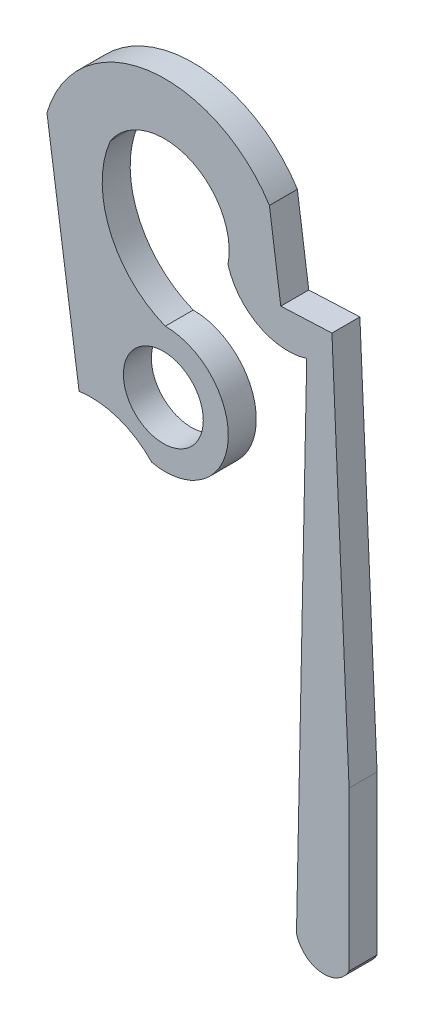
ISO-10303-21;
HEADER;
FILE_DESCRIPTION(('STEP AP214'),'2;1');
FILE_NAME('part.step','',(''),(''),'','','');
FILE_SCHEMA(('AUTOMOTIVE_DESIGN { 1 0 10303 214 1 1 1 1 }'));
ENDSEC;
DATA;
#1=APPLICATION_CONTEXT('core data for automotive mechanical design processes');
#2=APPLICATION_PROTOCOL_DEFINITION('international standard','automotive_design',2000,#1);
#3=PRODUCT_CONTEXT('',#1,'mechanical');
#4=PRODUCT('Part','Part','',(#3));
#5=PRODUCT_RELATED_PRODUCT_CATEGORY('part','',(#4));
#6=PRODUCT_DEFINITION_FORMATION('','',#4);
#7=PRODUCT_DEFINITION_CONTEXT('part definition',#1,'design');
#8=PRODUCT_DEFINITION('design','',#6,#7);
#9=PRODUCT_DEFINITION_SHAPE('','',#8);
#10=(LENGTH_UNIT() NAMED_UNIT(*) SI_UNIT(.MILLI.,.METRE.));
#11=(NAMED_UNIT(*) PLANE_ANGLE_UNIT() SI_UNIT($,.RADIAN.));
#12=(NAMED_UNIT(*) SI_UNIT($,.STERADIAN.) SOLID_ANGLE_UNIT());
#13=UNCERTAINTY_MEASURE_WITH_UNIT(LENGTH_MEASURE(1.E-05),#10,'distance_accuracy_value','');
#14=(GEOMETRIC_REPRESENTATION_CONTEXT(3) GLOBAL_UNCERTAINTY_ASSIGNED_CONTEXT((#13)) GLOBAL_UNIT_ASSIGNED_CONTEXT((#10,
#11,#12)) REPRESENTATION_CONTEXT('',''));
#15=CARTESIAN_POINT('',(0.,0.,0.));
#16=DIRECTION('',(0.,0.,1.));
#17=DIRECTION('',(1.,0.,0.));
#18=AXIS2_PLACEMENT_3D('',#15,#16,#17);
#19=CARTESIAN_POINT('',(-0.764555015026057,6.89651456807278,0.889));
#20=DIRECTION('',(0.,0.,1.));
#21=DIRECTION('',(1.,0.,0.));
#22=AXIS2_PLACEMENT_3D('',#19,#20,#21);
#23=PLANE('',#22);
#24=CARTESIAN_POINT('',(-0.764555015026057,6.89651456807278,0.889));
#25=DIRECTION('',(0.,0.,1.));
#26=DIRECTION('',(1.,0.,0.));
#27=AXIS2_PLACEMENT_3D('',#24,#25,#26);
#28=CIRCLE('',#27,3.91525112739899);
#29=CARTESIAN_POINT('',(2.54878635499703,8.98241014462799,0.889));
#30=VERTEX_POINT('',#29);
#31=CARTESIAN_POINT('',(-4.52195711683766,7.99702392100933,0.889));
#32=VERTEX_POINT('',#31);
#33=EDGE_CURVE('E218',#30,#32,#28,.T.);
#34=ORIENTED_EDGE('',*,*,#33,.T.);
#35=DIRECTION('',(0.141342617422506,-0.98996073886804,0.));
#36=VECTOR('',#35,1.);
#37=CARTESIAN_POINT('',(-4.52195711683766,7.99702392100933,0.889));
#38=LINE('',#37,#36);
#39=CARTESIAN_POINT('',(-3.50064084270403,0.843746078863655,0.889));
#40=VERTEX_POINT('',#39);
#41=EDGE_CURVE('E124',#32,#40,#38,.T.);
#42=ORIENTED_EDGE('',*,*,#41,.T.);
#43=CARTESIAN_POINT('',(-3.12450204033118,-1.80167889257873,0.889));
#44=DIRECTION('',(0.,0.,-1.));
#45=DIRECTION('',(-1.,0.,0.));
#46=AXIS2_PLACEMENT_3D('',#43,#44,#45);
#47=CIRCLE('',#46,2.67203175096808);
#48=CARTESIAN_POINT('',(-1.18943230542014,0.0409439117990268,0.889));
#49=VERTEX_POINT('',#48);
#50=EDGE_CURVE('E259',#40,#49,#47,.T.);
#51=ORIENTED_EDGE('',*,*,#50,.T.);
#52=CARTESIAN_POINT('',(-0.761885284854942,1.99978176323309,0.889));
#53=DIRECTION('',(0.,0.,1.));
#54=DIRECTION('',(1.,0.,0.));
#55=AXIS2_PLACEMENT_3D('',#52,#53,#54);
#56=CIRCLE('',#55,2.00495440920861);
#57=CARTESIAN_POINT('',(-0.76188528485497,4.0047361724417,0.889));
#58=VERTEX_POINT('',#57);
#59=EDGE_CURVE('E279',#49,#58,#56,.T.);
#60=ORIENTED_EDGE('',*,*,#59,.T.);
#61=CARTESIAN_POINT('',(0.431221925221187,6.97103879163964,0.889));
#62=DIRECTION('',(0.,0.,-1.));
#63=DIRECTION('',(-1.,0.,0.));
#64=AXIS2_PLACEMENT_3D('',#61,#62,#63);
#65=CIRCLE('',#64,3.19725758164653);
#66=CARTESIAN_POINT('',(-2.50756187158796,8.23040602918722,0.889));
#67=VERTEX_POINT('',#66);
#68=EDGE_CURVE('E275',#58,#67,#65,.T.);
#69=ORIENTED_EDGE('',*,*,#68,.T.);
#70=CARTESIAN_POINT('',(-0.789552238138536,7.09308352010314,0.889));
#71=DIRECTION('',(0.,0.,-1.));
#72=DIRECTION('',(-1.,0.,0.));
#73=AXIS2_PLACEMENT_3D('',#70,#71,#72);
#74=CIRCLE('',#73,2.06035423903132);
#75=CARTESIAN_POINT('',(1.2324345503255,6.69731967944675,0.889));
#76=VERTEX_POINT('',#75);
#77=EDGE_CURVE('E278',#67,#76,#74,.T.);
#78=ORIENTED_EDGE('',*,*,#77,.T.);
#79=CARTESIAN_POINT('',(3.13473023692255,7.25343080850267,0.889));
#80=DIRECTION('',(0.,0.,1.));
#81=DIRECTION('',(1.,0.,0.));
#82=AXIS2_PLACEMENT_3D('',#79,#80,#81);
#83=CIRCLE('',#82,1.98191535316357);
#84=CARTESIAN_POINT('',(3.73486881188279,5.36456285177563,0.889));
#85=VERTEX_POINT('',#84);
#86=EDGE_CURVE('E283',#76,#85,#83,.T.);
#87=ORIENTED_EDGE('',*,*,#86,.T.);
#88=DIRECTION('',(-0.0203457676218141,-0.999793003446153,0.));
#89=VECTOR('',#88,1.);
#90=CARTESIAN_POINT('',(3.73486881188279,5.36456285177564,0.889));
#91=LINE('',#90,#89);
#92=CARTESIAN_POINT('',(3.40964775399991,-10.616831622425,0.889));
#93=VERTEX_POINT('',#92);
#94=EDGE_CURVE('E290',#85,#93,#91,.T.);
#95=ORIENTED_EDGE('',*,*,#94,.T.);
#96=CARTESIAN_POINT('',(4.28443912780325,-10.4110378817667,0.889));
#97=DIRECTION('',(0.,0.,1.));
#98=DIRECTION('',(1.,0.,0.));
#99=AXIS2_PLACEMENT_3D('',#96,#97,#98);
#100=CIRCLE('',#99,0.898671804039087);
#101=CARTESIAN_POINT('',(5.08128140266139,-10.8265537062232,0.889));
#102=VERTEX_POINT('',#101);
#103=EDGE_CURVE('E293',#93,#102,#100,.T.);
#104=ORIENTED_EDGE('',*,*,#103,.T.);
#105=DIRECTION('',(0.,1.,0.));
#106=VECTOR('',#105,1.);
#107=CARTESIAN_POINT('',(5.08128140266139,-10.8265537062232,0.889));
#108=LINE('',#107,#106);
#109=CARTESIAN_POINT('',(5.08128140266142,-5.78834765871356,0.889));
#110=VERTEX_POINT('',#109);
#111=EDGE_CURVE('E158',#102,#110,#108,.T.);
#112=ORIENTED_EDGE('',*,*,#111,.T.);
#113=DIRECTION('',(-0.0444556497936911,0.999011358895093,0.));
#114=VECTOR('',#113,1.);
#115=CARTESIAN_POINT('',(4.53606219398666,6.46386741589675,0.889));
#116=LINE('',#115,#114);
#117=CARTESIAN_POINT('',(4.53606219398666,6.46386741589675,0.889));
#118=VERTEX_POINT('',#117);
#119=EDGE_CURVE('E152',#110,#118,#116,.T.);
#120=ORIENTED_EDGE('',*,*,#119,.T.);
#121=DIRECTION('',(-0.999011358895093,-0.044455649793691,0.));
#122=VECTOR('',#121,1.);
#123=CARTESIAN_POINT('',(2.91034581646799,6.39152361589957,0.889));
#124=LINE('',#123,#122);
#125=CARTESIAN_POINT('',(2.91034581646799,6.39152361589957,0.889));
#126=VERTEX_POINT('',#125);
#127=EDGE_CURVE('E156',#118,#126,#124,.T.);
#128=ORIENTED_EDGE('',*,*,#127,.T.);
#129=DIRECTION('',(-0.138211184527533,0.990402780928798,0.));
#130=VECTOR('',#129,1.);
#131=CARTESIAN_POINT('',(2.54878635499703,8.98241014462799,0.889));
#132=LINE('',#131,#130);
#133=EDGE_CURVE('E66',#126,#30,#132,.T.);
#134=ORIENTED_EDGE('',*,*,#133,.T.);
#135=EDGE_LOOP('',(#34,#42,#51,#60,#69,#78,#87,#95,#104,#112,#120,#128,#134));
#136=FACE_BOUND('',#135,.T.);
#137=CARTESIAN_POINT('',(-0.822961987657009,2.0129242920782,0.889));
#138=DIRECTION('',(0.,0.,1.));
#139=DIRECTION('',(1.,0.,0.));
#140=AXIS2_PLACEMENT_3D('',#137,#138,#139);
#141=CIRCLE('',#140,1.27);
#142=CARTESIAN_POINT('',(0.447038012342992,2.0129242920782,0.889));
#143=VERTEX_POINT('',#142);
#144=EDGE_CURVE('E185',#143,#143,#141,.T.);
#145=ORIENTED_EDGE('',*,*,#144,.F.);
#146=EDGE_LOOP('',(#145));
#147=FACE_BOUND('',#146,.T.);
#148=ADVANCED_FACE('F48',(#136,#147),#23,.T.);
#149=CARTESIAN_POINT('',(-0.764555015026057,6.89651456807278,0.));
#150=DIRECTION('',(0.,0.,1.));
#151=DIRECTION('',(1.,0.,0.));
#152=AXIS2_PLACEMENT_3D('',#149,#150,#151);
#153=PLANE('',#152);
#154=CARTESIAN_POINT('',(-0.764555015026057,6.89651456807278,0.));
#155=DIRECTION('',(0.,0.,1.));
#156=DIRECTION('',(1.,0.,0.));
#157=AXIS2_PLACEMENT_3D('',#154,#155,#156);
#158=CIRCLE('',#157,3.91525112739899);
#159=CARTESIAN_POINT('',(2.54878635499703,8.98241014462799,0.));
#160=VERTEX_POINT('',#159);
#161=CARTESIAN_POINT('',(-4.52195711683766,7.99702392100933,0.));
#162=VERTEX_POINT('',#161);
#163=EDGE_CURVE('E180',#160,#162,#158,.T.);
#164=ORIENTED_EDGE('',*,*,#163,.F.);
#165=DIRECTION('',(-0.138211184527533,0.990402780928798,0.));
#166=VECTOR('',#165,1.);
#167=CARTESIAN_POINT('',(2.54878635499703,8.98241014462799,0.));
#168=LINE('',#167,#166);
#169=CARTESIAN_POINT('',(2.91034581646799,6.39152361589957,0.));
#170=VERTEX_POINT('',#169);
#171=EDGE_CURVE('E116',#170,#160,#168,.T.);
#172=ORIENTED_EDGE('',*,*,#171,.F.);
#173=DIRECTION('',(-0.999011358895093,-0.044455649793691,0.));
#174=VECTOR('',#173,1.);
#175=CARTESIAN_POINT('',(2.91034581646799,6.39152361589957,0.));
#176=LINE('',#175,#174);
#177=CARTESIAN_POINT('',(4.53606219398666,6.46386741589675,0.));
#178=VERTEX_POINT('',#177);
#179=EDGE_CURVE('E110',#178,#170,#176,.T.);
#180=ORIENTED_EDGE('',*,*,#179,.F.);
#181=DIRECTION('',(-0.0444556497936911,0.999011358895093,0.));
#182=VECTOR('',#181,1.);
#183=CARTESIAN_POINT('',(4.53606219398666,6.46386741589675,0.));
#184=LINE('',#183,#182);
#185=CARTESIAN_POINT('',(5.08128140266142,-5.78834765871356,0.));
#186=VERTEX_POINT('',#185);
#187=EDGE_CURVE('E167',#186,#178,#184,.T.);
#188=ORIENTED_EDGE('',*,*,#187,.F.);
#189=DIRECTION('',(0.,1.,0.));
#190=VECTOR('',#189,1.);
#191=CARTESIAN_POINT('',(5.08128140266139,-10.8265537062232,0.));
#192=LINE('',#191,#190);
#193=CARTESIAN_POINT('',(5.08128140266139,-10.8265537062232,0.));
#194=VERTEX_POINT('',#193);
#195=EDGE_CURVE('E209',#194,#186,#192,.T.);
#196=ORIENTED_EDGE('',*,*,#195,.F.);
#197=CARTESIAN_POINT('',(4.28443912780325,-10.4110378817667,0.));
#198=DIRECTION('',(0.,0.,1.));
#199=DIRECTION('',(1.,0.,0.));
#200=AXIS2_PLACEMENT_3D('',#197,#198,#199);
#201=CIRCLE('',#200,0.898671804039087);
#202=CARTESIAN_POINT('',(3.40964775399991,-10.616831622425,0.));
#203=VERTEX_POINT('',#202);
#204=EDGE_CURVE('E206',#203,#194,#201,.T.);
#205=ORIENTED_EDGE('',*,*,#204,.F.);
#206=DIRECTION('',(-0.0203457676218141,-0.999793003446153,0.));
#207=VECTOR('',#206,1.);
#208=CARTESIAN_POINT('',(3.73486881188279,5.36456285177564,0.));
#209=LINE('',#208,#207);
#210=CARTESIAN_POINT('',(3.73486881188279,5.36456285177563,0.));
#211=VERTEX_POINT('',#210);
#212=EDGE_CURVE('E203',#211,#203,#209,.T.);
#213=ORIENTED_EDGE('',*,*,#212,.F.);
#214=CARTESIAN_POINT('',(3.13473023692255,7.25343080850267,0.));
#215=DIRECTION('',(0.,0.,1.));
#216=DIRECTION('',(1.,0.,0.));
#217=AXIS2_PLACEMENT_3D('',#214,#215,#216);
#218=CIRCLE('',#217,1.98191535316357);
#219=CARTESIAN_POINT('',(1.2324345503255,6.69731967944675,0.));
#220=VERTEX_POINT('',#219);
#221=EDGE_CURVE('E200',#220,#211,#218,.T.);
#222=ORIENTED_EDGE('',*,*,#221,.F.);
#223=CARTESIAN_POINT('',(-0.789552238138536,7.09308352010314,0.));
#224=DIRECTION('',(0.,0.,-1.));
#225=DIRECTION('',(-1.,0.,0.));
#226=AXIS2_PLACEMENT_3D('',#223,#224,#225);
#227=CIRCLE('',#226,2.06035423903132);
#228=CARTESIAN_POINT('',(-2.50756187158796,8.23040602918722,0.));
#229=VERTEX_POINT('',#228);
#230=EDGE_CURVE('E197',#229,#220,#227,.T.);
#231=ORIENTED_EDGE('',*,*,#230,.F.);
#232=CARTESIAN_POINT('',(0.431221925221187,6.97103879163964,0.));
#233=DIRECTION('',(0.,0.,-1.));
#234=DIRECTION('',(-1.,0.,0.));
#235=AXIS2_PLACEMENT_3D('',#232,#233,#234);
#236=CIRCLE('',#235,3.19725758164653);
#237=CARTESIAN_POINT('',(-0.76188528485497,4.0047361724417,0.));
#238=VERTEX_POINT('',#237);
#239=EDGE_CURVE('E194',#238,#229,#236,.T.);
#240=ORIENTED_EDGE('',*,*,#239,.F.);
#241=CARTESIAN_POINT('',(-0.761885284854942,1.99978176323309,0.));
#242=DIRECTION('',(0.,0.,1.));
#243=DIRECTION('',(1.,0.,0.));
#244=AXIS2_PLACEMENT_3D('',#241,#242,#243);
#245=CIRCLE('',#244,2.00495440920861);
#246=CARTESIAN_POINT('',(-1.18943230542014,0.0409439117990268,0.));
#247=VERTEX_POINT('',#246);
#248=EDGE_CURVE('E191',#247,#238,#245,.T.);
#249=ORIENTED_EDGE('',*,*,#248,.F.);
#250=CARTESIAN_POINT('',(-3.12450204033118,-1.80167889257873,0.));
#251=DIRECTION('',(0.,0.,-1.));
#252=DIRECTION('',(-1.,0.,0.));
#253=AXIS2_PLACEMENT_3D('',#250,#251,#252);
#254=CIRCLE('',#253,2.67203175096808);
#255=CARTESIAN_POINT('',(-3.50064084270403,0.843746078863655,0.));
#256=VERTEX_POINT('',#255);
#257=EDGE_CURVE('E188',#256,#247,#254,.T.);
#258=ORIENTED_EDGE('',*,*,#257,.F.);
#259=DIRECTION('',(0.141342617422506,-0.98996073886804,0.));
#260=VECTOR('',#259,1.);
#261=CARTESIAN_POINT('',(-4.52195711683766,7.99702392100933,0.));
#262=LINE('',#261,#260);
#263=EDGE_CURVE('E184',#162,#256,#262,.T.);
#264=ORIENTED_EDGE('',*,*,#263,.F.);
#265=EDGE_LOOP('',(#164,#172,#180,#188,#196,#205,#213,#222,#231,#240,#249,#258,#264));
#266=FACE_BOUND('',#265,.T.);
#267=CARTESIAN_POINT('',(-0.822961987657009,2.0129242920782,0.));
#268=DIRECTION('',(0.,0.,1.));
#269=DIRECTION('',(1.,0.,0.));
#270=AXIS2_PLACEMENT_3D('',#267,#268,#269);
#271=CIRCLE('',#270,1.27);
#272=CARTESIAN_POINT('',(0.447038012342992,2.0129242920782,0.));
#273=VERTEX_POINT('',#272);
#274=EDGE_CURVE('E423',#273,#273,#271,.T.);
#275=ORIENTED_EDGE('',*,*,#274,.T.);
#276=EDGE_LOOP('',(#275));
#277=FACE_BOUND('',#276,.T.);
#278=ADVANCED_FACE('F263',(#266,#277),#153,.F.);
#279=CARTESIAN_POINT('',(-0.764555015026057,6.89651456807278,0.889));
#280=DIRECTION('',(0.,0.,-1.));
#281=DIRECTION('',(-1.,0.,0.));
#282=AXIS2_PLACEMENT_3D('',#279,#280,#281);
#283=CYLINDRICAL_SURFACE('',#282,3.91525112739899);
#284=ORIENTED_EDGE('',*,*,#163,.T.);
#285=DIRECTION('',(0.,0.,-1.));
#286=VECTOR('',#285,1.);
#287=CARTESIAN_POINT('',(-4.52195711683766,7.99702392100933,0.889));
#288=LINE('',#287,#286);
#289=EDGE_CURVE('E13',#32,#162,#288,.T.);
#290=ORIENTED_EDGE('',*,*,#289,.F.);
#291=ORIENTED_EDGE('',*,*,#33,.F.);
#292=DIRECTION('',(0.,0.,-1.));
#293=VECTOR('',#292,1.);
#294=CARTESIAN_POINT('',(2.54878635499703,8.98241014462799,0.889));
#295=LINE('',#294,#293);
#296=EDGE_CURVE('E176',#30,#160,#295,.T.);
#297=ORIENTED_EDGE('',*,*,#296,.T.);
#298=EDGE_LOOP('',(#284,#290,#291,#297));
#299=FACE_BOUND('',#298,.T.);
#300=ADVANCED_FACE('F50',(#299),#283,.T.);
#301=CARTESIAN_POINT('',(-4.52195711683766,7.99702392100933,0.889));
#302=DIRECTION('',(0.98996073886804,0.141342617422506,0.));
#303=DIRECTION('',(-0.141342617422506,0.98996073886804,0.));
#304=AXIS2_PLACEMENT_3D('',#301,#302,#303);
#305=PLANE('',#304);
#306=ORIENTED_EDGE('',*,*,#263,.T.);
#307=DIRECTION('',(0.,0.,-1.));
#308=VECTOR('',#307,1.);
#309=CARTESIAN_POINT('',(-3.50064084270403,0.843746078863655,0.889));
#310=LINE('',#309,#308);
#311=EDGE_CURVE('E58',#40,#256,#310,.T.);
#312=ORIENTED_EDGE('',*,*,#311,.F.);
#313=ORIENTED_EDGE('',*,*,#41,.F.);
#314=ORIENTED_EDGE('',*,*,#289,.T.);
#315=EDGE_LOOP('',(#306,#312,#313,#314));
#316=FACE_BOUND('',#315,.T.);
#317=ADVANCED_FACE('F329',(#316),#305,.F.);
#318=CARTESIAN_POINT('',(-3.12450204033118,-1.80167889257873,0.889));
#319=DIRECTION('',(0.,0.,-1.));
#320=DIRECTION('',(-1.,0.,0.));
#321=AXIS2_PLACEMENT_3D('',#318,#319,#320);
#322=CYLINDRICAL_SURFACE('',#321,2.67203175096808);
#323=ORIENTED_EDGE('',*,*,#257,.T.);
#324=DIRECTION('',(0.,0.,-1.));
#325=VECTOR('',#324,1.);
#326=CARTESIAN_POINT('',(-1.18943230542014,0.0409439117990268,0.889));
#327=LINE('',#326,#325);
#328=EDGE_CURVE('E249',#49,#247,#327,.T.);
#329=ORIENTED_EDGE('',*,*,#328,.F.);
#330=ORIENTED_EDGE('',*,*,#50,.F.);
#331=ORIENTED_EDGE('',*,*,#311,.T.);
#332=EDGE_LOOP('',(#323,#329,#330,#331));
#333=FACE_BOUND('',#332,.T.);
#334=ADVANCED_FACE('F257',(#333),#322,.F.);
#335=CARTESIAN_POINT('',(-0.761885284854942,1.99978176323309,0.889));
#336=DIRECTION('',(0.,0.,-1.));
#337=DIRECTION('',(-1.,0.,0.));
#338=AXIS2_PLACEMENT_3D('',#335,#336,#337);
#339=CYLINDRICAL_SURFACE('',#338,2.00495440920861);
#340=ORIENTED_EDGE('',*,*,#248,.T.);
#341=DIRECTION('',(0.,0.,-1.));
#342=VECTOR('',#341,1.);
#343=CARTESIAN_POINT('',(-0.76188528485497,4.0047361724417,0.889));
#344=LINE('',#343,#342);
#345=EDGE_CURVE('E245',#58,#238,#344,.T.);
#346=ORIENTED_EDGE('',*,*,#345,.F.);
#347=ORIENTED_EDGE('',*,*,#59,.F.);
#348=ORIENTED_EDGE('',*,*,#328,.T.);
#349=EDGE_LOOP('',(#340,#346,#347,#348));
#350=FACE_BOUND('',#349,.T.);
#351=ADVANCED_FACE('F269',(#350),#339,.T.);
#352=CARTESIAN_POINT('',(0.431221925221187,6.97103879163964,0.889));
#353=DIRECTION('',(0.,0.,-1.));
#354=DIRECTION('',(-1.,0.,0.));
#355=AXIS2_PLACEMENT_3D('',#352,#353,#354);
#356=CYLINDRICAL_SURFACE('',#355,3.19725758164653);
#357=ORIENTED_EDGE('',*,*,#239,.T.);
#358=DIRECTION('',(0.,0.,-1.));
#359=VECTOR('',#358,1.);
#360=CARTESIAN_POINT('',(-2.50756187158796,8.23040602918722,0.889));
#361=LINE('',#360,#359);
#362=EDGE_CURVE('E241',#67,#229,#361,.T.);
#363=ORIENTED_EDGE('',*,*,#362,.F.);
#364=ORIENTED_EDGE('',*,*,#68,.F.);
#365=ORIENTED_EDGE('',*,*,#345,.T.);
#366=EDGE_LOOP('',(#357,#363,#364,#365));
#367=FACE_BOUND('',#366,.T.);
#368=ADVANCED_FACE('F273',(#367),#356,.F.);
#369=CARTESIAN_POINT('',(-0.789552238138536,7.09308352010314,0.889));
#370=DIRECTION('',(0.,0.,-1.));
#371=DIRECTION('',(-1.,0.,0.));
#372=AXIS2_PLACEMENT_3D('',#369,#370,#371);
#373=CYLINDRICAL_SURFACE('',#372,2.06035423903132);
#374=ORIENTED_EDGE('',*,*,#230,.T.);
#375=DIRECTION('',(0.,0.,-1.));
#376=VECTOR('',#375,1.);
#377=CARTESIAN_POINT('',(1.2324345503255,6.69731967944675,0.889));
#378=LINE('',#377,#376);
#379=EDGE_CURVE('E237',#76,#220,#378,.T.);
#380=ORIENTED_EDGE('',*,*,#379,.F.);
#381=ORIENTED_EDGE('',*,*,#77,.F.);
#382=ORIENTED_EDGE('',*,*,#362,.T.);
#383=EDGE_LOOP('',(#374,#380,#381,#382));
#384=FACE_BOUND('',#383,.T.);
#385=ADVANCED_FACE('F342',(#384),#373,.F.);
#386=CARTESIAN_POINT('',(3.13473023692255,7.25343080850267,0.889));
#387=DIRECTION('',(0.,0.,-1.));
#388=DIRECTION('',(-1.,0.,0.));
#389=AXIS2_PLACEMENT_3D('',#386,#387,#388);
#390=CYLINDRICAL_SURFACE('',#389,1.98191535316357);
#391=ORIENTED_EDGE('',*,*,#221,.T.);
#392=DIRECTION('',(0.,0.,-1.));
#393=VECTOR('',#392,1.);
#394=CARTESIAN_POINT('',(3.73486881188279,5.36456285177563,0.889));
#395=LINE('',#394,#393);
#396=EDGE_CURVE('E233',#85,#211,#395,.T.);
#397=ORIENTED_EDGE('',*,*,#396,.F.);
#398=ORIENTED_EDGE('',*,*,#86,.F.);
#399=ORIENTED_EDGE('',*,*,#379,.T.);
#400=EDGE_LOOP('',(#391,#397,#398,#399));
#401=FACE_BOUND('',#400,.T.);
#402=ADVANCED_FACE('F345',(#401),#390,.T.);
#403=CARTESIAN_POINT('',(3.73486881188279,5.36456285177564,0.889));
#404=DIRECTION('',(0.999793003446153,-0.0203457676218142,0.));
#405=DIRECTION('',(0.0203457676218142,0.999793003446153,0.));
#406=AXIS2_PLACEMENT_3D('',#403,#404,#405);
#407=PLANE('',#406);
#408=ORIENTED_EDGE('',*,*,#212,.T.);
#409=DIRECTION('',(0.,0.,-1.));
#410=VECTOR('',#409,1.);
#411=CARTESIAN_POINT('',(3.40964775399991,-10.616831622425,0.889));
#412=LINE('',#411,#410);
#413=EDGE_CURVE('E229',#93,#203,#412,.T.);
#414=ORIENTED_EDGE('',*,*,#413,.F.);
#415=ORIENTED_EDGE('',*,*,#94,.F.);
#416=ORIENTED_EDGE('',*,*,#396,.T.);
#417=EDGE_LOOP('',(#408,#414,#415,#416));
#418=FACE_BOUND('',#417,.T.);
#419=ADVANCED_FACE('F349',(#418),#407,.F.);
#420=CARTESIAN_POINT('',(4.28443912780325,-10.4110378817667,0.889));
#421=DIRECTION('',(0.,0.,-1.));
#422=DIRECTION('',(-1.,0.,0.));
#423=AXIS2_PLACEMENT_3D('',#420,#421,#422);
#424=CYLINDRICAL_SURFACE('',#423,0.898671804039087);
#425=ORIENTED_EDGE('',*,*,#204,.T.);
#426=DIRECTION('',(0.,0.,-1.));
#427=VECTOR('',#426,1.);
#428=CARTESIAN_POINT('',(5.08128140266139,-10.8265537062232,0.889));
#429=LINE('',#428,#427);
#430=EDGE_CURVE('E225',#102,#194,#429,.T.);
#431=ORIENTED_EDGE('',*,*,#430,.F.);
#432=ORIENTED_EDGE('',*,*,#103,.F.);
#433=ORIENTED_EDGE('',*,*,#413,.T.);
#434=EDGE_LOOP('',(#425,#431,#432,#433));
#435=FACE_BOUND('',#434,.T.);
#436=ADVANCED_FACE('F301',(#435),#424,.T.);
#437=CARTESIAN_POINT('',(5.08128140266139,-10.8265537062232,0.889));
#438=DIRECTION('',(-1.,0.,0.));
#439=DIRECTION('',(0.,0.,1.));
#440=AXIS2_PLACEMENT_3D('',#437,#438,#439);
#441=PLANE('',#440);
#442=ORIENTED_EDGE('',*,*,#195,.T.);
#443=DIRECTION('',(0.,0.,-1.));
#444=VECTOR('',#443,1.);
#445=CARTESIAN_POINT('',(5.08128140266142,-5.78834765871356,0.889));
#446=LINE('',#445,#444);
#447=EDGE_CURVE('E169',#110,#186,#446,.T.);
#448=ORIENTED_EDGE('',*,*,#447,.F.);
#449=ORIENTED_EDGE('',*,*,#111,.F.);
#450=ORIENTED_EDGE('',*,*,#430,.T.);
#451=EDGE_LOOP('',(#442,#448,#449,#450));
#452=FACE_BOUND('',#451,.T.);
#453=ADVANCED_FACE('F305',(#452),#441,.F.);
#454=CARTESIAN_POINT('',(4.53606219398666,6.46386741589675,0.889));
#455=DIRECTION('',(-0.999011358895093,-0.0444556497936911,0.));
#456=DIRECTION('',(0.0444556497936911,-0.999011358895093,0.));
#457=AXIS2_PLACEMENT_3D('',#454,#455,#456);
#458=PLANE('',#457);
#459=ORIENTED_EDGE('',*,*,#187,.T.);
#460=DIRECTION('',(0.,0.,-1.));
#461=VECTOR('',#460,1.);
#462=CARTESIAN_POINT('',(4.53606219398666,6.46386741589675,0.889));
#463=LINE('',#462,#461);
#464=EDGE_CURVE('E164',#118,#178,#463,.T.);
#465=ORIENTED_EDGE('',*,*,#464,.F.);
#466=ORIENTED_EDGE('',*,*,#119,.F.);
#467=ORIENTED_EDGE('',*,*,#447,.T.);
#468=EDGE_LOOP('',(#459,#465,#466,#467));
#469=FACE_BOUND('',#468,.T.);
#470=ADVANCED_FACE('F165',(#469),#458,.F.);
#471=CARTESIAN_POINT('',(2.91034581646799,6.39152361589957,0.889));
#472=DIRECTION('',(0.044455649793691,-0.999011358895093,0.));
#473=DIRECTION('',(0.999011358895093,0.044455649793691,0.));
#474=AXIS2_PLACEMENT_3D('',#471,#472,#473);
#475=PLANE('',#474);
#476=ORIENTED_EDGE('',*,*,#179,.T.);
#477=DIRECTION('',(0.,0.,-1.));
#478=VECTOR('',#477,1.);
#479=CARTESIAN_POINT('',(2.91034581646799,6.39152361589957,0.889));
#480=LINE('',#479,#478);
#481=EDGE_CURVE('E170',#126,#170,#480,.T.);
#482=ORIENTED_EDGE('',*,*,#481,.F.);
#483=ORIENTED_EDGE('',*,*,#127,.F.);
#484=ORIENTED_EDGE('',*,*,#464,.T.);
#485=EDGE_LOOP('',(#476,#482,#483,#484));
#486=FACE_BOUND('',#485,.T.);
#487=ADVANCED_FACE('F172',(#486),#475,.F.);
#488=CARTESIAN_POINT('',(2.54878635499703,8.98241014462799,0.889));
#489=DIRECTION('',(-0.990402780928798,-0.138211184527533,0.));
#490=DIRECTION('',(0.138211184527533,-0.990402780928798,0.));
#491=AXIS2_PLACEMENT_3D('',#488,#489,#490);
#492=PLANE('',#491);
#493=ORIENTED_EDGE('',*,*,#171,.T.);
#494=ORIENTED_EDGE('',*,*,#296,.F.);
#495=ORIENTED_EDGE('',*,*,#133,.F.);
#496=ORIENTED_EDGE('',*,*,#481,.T.);
#497=EDGE_LOOP('',(#493,#494,#495,#496));
#498=FACE_BOUND('',#497,.T.);
#499=ADVANCED_FACE('F309',(#498),#492,.F.);
#500=CARTESIAN_POINT('',(-0.822961987657009,2.0129242920782,0.889));
#501=DIRECTION('',(0.,0.,-1.));
#502=DIRECTION('',(-1.,0.,0.));
#503=AXIS2_PLACEMENT_3D('',#500,#501,#502);
#504=CYLINDRICAL_SURFACE('',#503,1.27);
#505=ORIENTED_EDGE('',*,*,#144,.T.);
#506=EDGE_LOOP('',(#505));
#507=FACE_BOUND('',#506,.T.);
#508=ORIENTED_EDGE('',*,*,#274,.F.);
#509=EDGE_LOOP('',(#508));
#510=FACE_BOUND('',#509,.T.);
#511=ADVANCED_FACE('F311',(#507,#510),#504,.F.);
#512=CLOSED_SHELL('',(#148,#278,#300,#317,#334,#351,#368,#385,#402,#419,#436,#453,#470,#487,
#499,#511));
#513=MANIFOLD_SOLID_BREP('B2',#512);
#514=ADVANCED_BREP_SHAPE_REPRESENTATION('',(#18,#513),#14);
#515=SHAPE_DEFINITION_REPRESENTATION(#9,#514);
ENDSEC;
END-ISO-10303-21;
